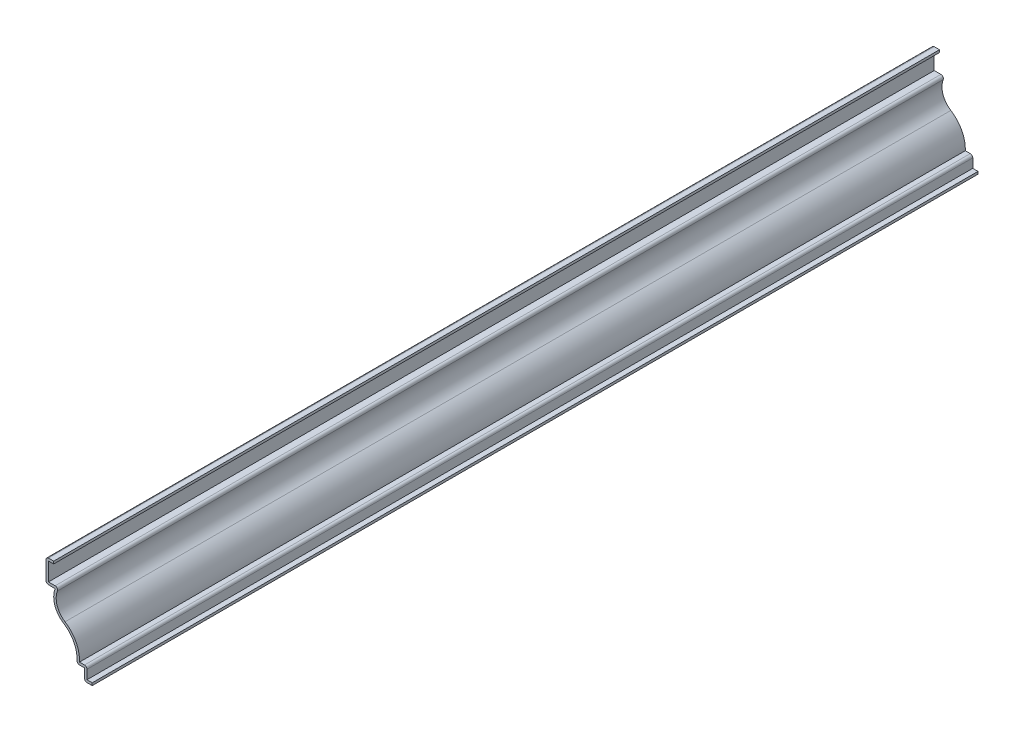
ISO-10303-21;
HEADER;
FILE_DESCRIPTION(('STEP AP214'),'2;1');
FILE_NAME('part.step','',(''),(''),'','','');
FILE_SCHEMA(('AUTOMOTIVE_DESIGN { 1 0 10303 214 1 1 1 1 }'));
ENDSEC;
DATA;
#1=APPLICATION_CONTEXT('core data for automotive mechanical design processes');
#2=APPLICATION_PROTOCOL_DEFINITION('international standard','automotive_design',2000,#1);
#3=PRODUCT_CONTEXT('',#1,'mechanical');
#4=PRODUCT('Part','Part','',(#3));
#5=PRODUCT_RELATED_PRODUCT_CATEGORY('part','',(#4));
#6=PRODUCT_DEFINITION_FORMATION('','',#4);
#7=PRODUCT_DEFINITION_CONTEXT('part definition',#1,'design');
#8=PRODUCT_DEFINITION('design','',#6,#7);
#9=PRODUCT_DEFINITION_SHAPE('','',#8);
#10=(LENGTH_UNIT() NAMED_UNIT(*) SI_UNIT(.MILLI.,.METRE.));
#11=(NAMED_UNIT(*) PLANE_ANGLE_UNIT() SI_UNIT($,.RADIAN.));
#12=(NAMED_UNIT(*) SI_UNIT($,.STERADIAN.) SOLID_ANGLE_UNIT());
#13=UNCERTAINTY_MEASURE_WITH_UNIT(LENGTH_MEASURE(1.E-05),#10,'distance_accuracy_value','');
#14=(GEOMETRIC_REPRESENTATION_CONTEXT(3) GLOBAL_UNCERTAINTY_ASSIGNED_CONTEXT((#13)) GLOBAL_UNIT_ASSIGNED_CONTEXT((#10,
#11,#12)) REPRESENTATION_CONTEXT('',''));
#15=CARTESIAN_POINT('',(0.,0.,0.));
#16=DIRECTION('',(0.,0.,1.));
#17=DIRECTION('',(1.,0.,0.));
#18=AXIS2_PLACEMENT_3D('',#15,#16,#17);
#19=CARTESIAN_POINT('',(-19.05,35.4965,-365.125));
#20=DIRECTION('',(0.,-1.,0.));
#21=DIRECTION('',(1.,0.,0.));
#22=AXIS2_PLACEMENT_3D('',#19,#20,#21);
#23=PLANE('',#22);
#24=DIRECTION('',(1.,0.,0.));
#25=VECTOR('',#24,1.);
#26=CARTESIAN_POINT('',(-19.05,35.4965,0.));
#27=LINE('',#26,#25);
#28=CARTESIAN_POINT('',(-18.034,35.4965,0.));
#29=VERTEX_POINT('',#28);
#30=CARTESIAN_POINT('',(-15.875,35.4965,0.));
#31=VERTEX_POINT('',#30);
#32=EDGE_CURVE('E264',#29,#31,#27,.T.);
#33=ORIENTED_EDGE('',*,*,#32,.F.);
#34=DIRECTION('',(0.,0.,1.));
#35=VECTOR('',#34,1.);
#36=CARTESIAN_POINT('',(-18.034,35.4965,-365.125));
#37=LINE('',#36,#35);
#38=CARTESIAN_POINT('',(-18.034,35.4965,-365.125));
#39=VERTEX_POINT('',#38);
#40=EDGE_CURVE('E221',#39,#29,#37,.T.);
#41=ORIENTED_EDGE('',*,*,#40,.F.);
#42=DIRECTION('',(1.,0.,0.));
#43=VECTOR('',#42,1.);
#44=CARTESIAN_POINT('',(-19.05,35.4965,-365.125));
#45=LINE('',#44,#43);
#46=CARTESIAN_POINT('',(-15.875,35.4965,-365.125));
#47=VERTEX_POINT('',#46);
#48=EDGE_CURVE('E203',#39,#47,#45,.T.);
#49=ORIENTED_EDGE('',*,*,#48,.T.);
#50=DIRECTION('',(0.,0.,1.));
#51=VECTOR('',#50,1.);
#52=CARTESIAN_POINT('',(-15.875,35.4965,-365.125));
#53=LINE('',#52,#51);
#54=EDGE_CURVE('E211',#47,#31,#53,.T.);
#55=ORIENTED_EDGE('',*,*,#54,.T.);
#56=EDGE_LOOP('',(#33,#41,#49,#55));
#57=FACE_BOUND('',#56,.T.);
#58=ADVANCED_FACE('F35',(#57),#23,.T.);
#59=CARTESIAN_POINT('',(-18.034,26.9875,-365.125));
#60=DIRECTION('',(1.,0.,0.));
#61=DIRECTION('',(0.,1.,0.));
#62=AXIS2_PLACEMENT_3D('',#59,#60,#61);
#63=PLANE('',#62);
#64=DIRECTION('',(0.,1.,0.));
#65=VECTOR('',#64,1.);
#66=CARTESIAN_POINT('',(-18.034,26.9875,0.));
#67=LINE('',#66,#65);
#68=CARTESIAN_POINT('',(-18.034,28.0035,0.));
#69=VERTEX_POINT('',#68);
#70=EDGE_CURVE('E222',#69,#29,#67,.T.);
#71=ORIENTED_EDGE('',*,*,#70,.F.);
#72=DIRECTION('',(0.,0.,1.));
#73=VECTOR('',#72,1.);
#74=CARTESIAN_POINT('',(-18.034,28.0035,-365.125));
#75=LINE('',#74,#73);
#76=CARTESIAN_POINT('',(-18.034,28.0035,-365.125));
#77=VERTEX_POINT('',#76);
#78=EDGE_CURVE('E305',#77,#69,#75,.T.);
#79=ORIENTED_EDGE('',*,*,#78,.F.);
#80=DIRECTION('',(0.,1.,0.));
#81=VECTOR('',#80,1.);
#82=CARTESIAN_POINT('',(-18.034,26.9875,-365.125));
#83=LINE('',#82,#81);
#84=EDGE_CURVE('E219',#77,#39,#83,.T.);
#85=ORIENTED_EDGE('',*,*,#84,.T.);
#86=ORIENTED_EDGE('',*,*,#40,.T.);
#87=EDGE_LOOP('',(#71,#79,#85,#86));
#88=FACE_BOUND('',#87,.T.);
#89=ADVANCED_FACE('F468',(#88),#63,.T.);
#90=CARTESIAN_POINT('',(-15.2861287044251,28.0035,-365.125));
#91=DIRECTION('',(0.,1.,0.));
#92=DIRECTION('',(0.,0.,1.));
#93=AXIS2_PLACEMENT_3D('',#90,#91,#92);
#94=PLANE('',#93);
#95=DIRECTION('',(1.,0.,0.));
#96=VECTOR('',#95,1.);
#97=CARTESIAN_POINT('',(-15.2861287044251,28.0035,0.));
#98=LINE('',#97,#96);
#99=CARTESIAN_POINT('',(-15.2861287044251,28.0035,0.));
#100=VERTEX_POINT('',#99);
#101=EDGE_CURVE('E225',#100,#69,#98,.F.);
#102=ORIENTED_EDGE('',*,*,#101,.F.);
#103=DIRECTION('',(0.,0.,1.));
#104=VECTOR('',#103,1.);
#105=CARTESIAN_POINT('',(-15.2861287044251,28.0035,-365.125));
#106=LINE('',#105,#104);
#107=CARTESIAN_POINT('',(-15.2861287044251,28.0035,-365.125));
#108=VERTEX_POINT('',#107);
#109=EDGE_CURVE('E43',#100,#108,#106,.F.);
#110=ORIENTED_EDGE('',*,*,#109,.T.);
#111=DIRECTION('',(1.,0.,0.));
#112=VECTOR('',#111,1.);
#113=CARTESIAN_POINT('',(-15.2861287044251,28.0035,-365.125));
#114=LINE('',#113,#112);
#115=EDGE_CURVE('E261',#108,#77,#114,.F.);
#116=ORIENTED_EDGE('',*,*,#115,.T.);
#117=ORIENTED_EDGE('',*,*,#78,.T.);
#118=EDGE_LOOP('',(#102,#110,#116,#117));
#119=FACE_BOUND('',#118,.T.);
#120=ADVANCED_FACE('F379',(#119),#94,.T.);
#121=CARTESIAN_POINT('',(-7.02128741364235,23.8125,-365.125));
#122=DIRECTION('',(0.,0.,1.));
#123=DIRECTION('',(1.,0.,0.));
#124=AXIS2_PLACEMENT_3D('',#121,#122,#123);
#125=CYLINDRICAL_SURFACE('',#124,7.83771258635766);
#126=CARTESIAN_POINT('',(-7.02128741364235,23.8125,-365.125));
#127=DIRECTION('',(0.,0.,1.));
#128=DIRECTION('',(1.,0.,0.));
#129=AXIS2_PLACEMENT_3D('',#126,#127,#128);
#130=CIRCLE('',#129,7.83771258635766);
#131=CARTESIAN_POINT('',(-11.2021641709878,17.1830197695266,-365.125));
#132=VERTEX_POINT('',#131);
#133=CARTESIAN_POINT('',(-14.3377041119695,26.6231556677737,-365.125));
#134=VERTEX_POINT('',#133);
#135=EDGE_CURVE('E258',#132,#134,#130,.F.);
#136=ORIENTED_EDGE('',*,*,#135,.T.);
#137=DIRECTION('',(0.,0.,1.));
#138=VECTOR('',#137,1.);
#139=CARTESIAN_POINT('',(-14.3377041119695,26.6231556677737,-365.125));
#140=LINE('',#139,#138);
#141=CARTESIAN_POINT('',(-14.3377041119695,26.6231556677737,0.));
#142=VERTEX_POINT('',#141);
#143=EDGE_CURVE('E373',#134,#142,#140,.T.);
#144=ORIENTED_EDGE('',*,*,#143,.T.);
#145=CARTESIAN_POINT('',(-7.02128741364235,23.8125,0.));
#146=DIRECTION('',(0.,0.,1.));
#147=DIRECTION('',(1.,0.,0.));
#148=AXIS2_PLACEMENT_3D('',#145,#146,#147);
#149=CIRCLE('',#148,7.83771258635766);
#150=CARTESIAN_POINT('',(-11.2021641709878,17.1830197695266,0.));
#151=VERTEX_POINT('',#150);
#152=EDGE_CURVE('E299',#151,#142,#149,.F.);
#153=ORIENTED_EDGE('',*,*,#152,.F.);
#154=DIRECTION('',(0.,0.,1.));
#155=VECTOR('',#154,1.);
#156=CARTESIAN_POINT('',(-11.2021641709878,17.1830197695266,-365.125));
#157=LINE('',#156,#155);
#158=EDGE_CURVE('E308',#132,#151,#157,.T.);
#159=ORIENTED_EDGE('',*,*,#158,.F.);
#160=EDGE_LOOP('',(#136,#144,#153,#159));
#161=FACE_BOUND('',#160,.T.);
#162=ADVANCED_FACE('F388',(#161),#125,.F.);
#163=CARTESIAN_POINT('',(-18.034,6.35,-365.125));
#164=DIRECTION('',(0.,0.,1.));
#165=DIRECTION('',(1.,0.,0.));
#166=AXIS2_PLACEMENT_3D('',#163,#164,#165);
#167=CYLINDRICAL_SURFACE('',#166,12.8073532832326);
#168=CARTESIAN_POINT('',(-18.034,6.35,0.));
#169=DIRECTION('',(0.,0.,1.));
#170=DIRECTION('',(1.,0.,0.));
#171=AXIS2_PLACEMENT_3D('',#168,#169,#170);
#172=CIRCLE('',#171,12.8073532832326);
#173=CARTESIAN_POINT('',(-5.23940403640941,5.7785,0.));
#174=VERTEX_POINT('',#173);
#175=EDGE_CURVE('E296',#174,#151,#172,.T.);
#176=ORIENTED_EDGE('',*,*,#175,.F.);
#177=DIRECTION('',(0.,0.,1.));
#178=VECTOR('',#177,1.);
#179=CARTESIAN_POINT('',(-5.23940403640941,5.7785,-365.125));
#180=LINE('',#179,#178);
#181=CARTESIAN_POINT('',(-5.23940403640941,5.7785,-365.125));
#182=VERTEX_POINT('',#181);
#183=EDGE_CURVE('E310',#182,#174,#180,.T.);
#184=ORIENTED_EDGE('',*,*,#183,.F.);
#185=CARTESIAN_POINT('',(-18.034,6.35,-365.125));
#186=DIRECTION('',(0.,0.,1.));
#187=DIRECTION('',(1.,0.,0.));
#188=AXIS2_PLACEMENT_3D('',#185,#186,#187);
#189=CIRCLE('',#188,12.8073532832326);
#190=EDGE_CURVE('E255',#182,#132,#189,.T.);
#191=ORIENTED_EDGE('',*,*,#190,.T.);
#192=ORIENTED_EDGE('',*,*,#158,.T.);
#193=EDGE_LOOP('',(#176,#184,#191,#192));
#194=FACE_BOUND('',#193,.T.);
#195=ADVANCED_FACE('F396',(#194),#167,.T.);
#196=CARTESIAN_POINT('',(-3.175,5.7785,-365.125));
#197=DIRECTION('',(0.,1.,0.));
#198=DIRECTION('',(0.,0.,1.));
#199=AXIS2_PLACEMENT_3D('',#196,#197,#198);
#200=PLANE('',#199);
#201=DIRECTION('',(1.,0.,0.));
#202=VECTOR('',#201,1.);
#203=CARTESIAN_POINT('',(-3.175,5.7785,0.));
#204=LINE('',#203,#202);
#205=CARTESIAN_POINT('',(-3.175,5.7785,0.));
#206=VERTEX_POINT('',#205);
#207=EDGE_CURVE('E294',#206,#174,#204,.F.);
#208=ORIENTED_EDGE('',*,*,#207,.F.);
#209=DIRECTION('',(0.,0.,1.));
#210=VECTOR('',#209,1.);
#211=CARTESIAN_POINT('',(-3.175,5.7785,-365.125));
#212=LINE('',#211,#210);
#213=CARTESIAN_POINT('',(-3.175,5.7785,-365.125));
#214=VERTEX_POINT('',#213);
#215=EDGE_CURVE('E371',#206,#214,#212,.F.);
#216=ORIENTED_EDGE('',*,*,#215,.T.);
#217=DIRECTION('',(1.,0.,0.));
#218=VECTOR('',#217,1.);
#219=CARTESIAN_POINT('',(-3.175,5.7785,-365.125));
#220=LINE('',#219,#218);
#221=EDGE_CURVE('E253',#214,#182,#220,.F.);
#222=ORIENTED_EDGE('',*,*,#221,.T.);
#223=ORIENTED_EDGE('',*,*,#183,.T.);
#224=EDGE_LOOP('',(#208,#216,#222,#223));
#225=FACE_BOUND('',#224,.T.);
#226=ADVANCED_FACE('F484',(#225),#200,.T.);
#227=CARTESIAN_POINT('',(-2.159,0.,-365.125));
#228=DIRECTION('',(1.,0.,0.));
#229=DIRECTION('',(0.,0.,-1.));
#230=AXIS2_PLACEMENT_3D('',#227,#228,#229);
#231=PLANE('',#230);
#232=DIRECTION('',(0.,1.,0.));
#233=VECTOR('',#232,1.);
#234=CARTESIAN_POINT('',(-2.159,0.,-365.125));
#235=LINE('',#234,#233);
#236=CARTESIAN_POINT('',(-2.159,1.016,-365.125));
#237=VERTEX_POINT('',#236);
#238=CARTESIAN_POINT('',(-2.159,4.7625,-365.125));
#239=VERTEX_POINT('',#238);
#240=EDGE_CURVE('E250',#237,#239,#235,.T.);
#241=ORIENTED_EDGE('',*,*,#240,.T.);
#242=DIRECTION('',(0.,0.,1.));
#243=VECTOR('',#242,1.);
#244=CARTESIAN_POINT('',(-2.159,4.7625,-365.125));
#245=LINE('',#244,#243);
#246=CARTESIAN_POINT('',(-2.159,4.7625,0.));
#247=VERTEX_POINT('',#246);
#248=EDGE_CURVE('E368',#239,#247,#245,.T.);
#249=ORIENTED_EDGE('',*,*,#248,.T.);
#250=DIRECTION('',(0.,1.,0.));
#251=VECTOR('',#250,1.);
#252=CARTESIAN_POINT('',(-2.159,0.,0.));
#253=LINE('',#252,#251);
#254=CARTESIAN_POINT('',(-2.159,1.016,0.));
#255=VERTEX_POINT('',#254);
#256=EDGE_CURVE('E291',#255,#247,#253,.T.);
#257=ORIENTED_EDGE('',*,*,#256,.F.);
#258=DIRECTION('',(0.,0.,1.));
#259=VECTOR('',#258,1.);
#260=CARTESIAN_POINT('',(-2.159,1.016,-365.125));
#261=LINE('',#260,#259);
#262=EDGE_CURVE('E313',#237,#255,#261,.T.);
#263=ORIENTED_EDGE('',*,*,#262,.F.);
#264=EDGE_LOOP('',(#241,#249,#257,#263));
#265=FACE_BOUND('',#264,.T.);
#266=ADVANCED_FACE('F408',(#265),#231,.T.);
#267=CARTESIAN_POINT('',(0.,1.016,-365.125));
#268=DIRECTION('',(0.,1.,0.));
#269=DIRECTION('',(-1.,0.,0.));
#270=AXIS2_PLACEMENT_3D('',#267,#268,#269);
#271=PLANE('',#270);
#272=DIRECTION('',(-1.,0.,0.));
#273=VECTOR('',#272,1.);
#274=CARTESIAN_POINT('',(0.,1.016,0.));
#275=LINE('',#274,#273);
#276=CARTESIAN_POINT('',(0.,1.016,0.));
#277=VERTEX_POINT('',#276);
#278=EDGE_CURVE('E288',#277,#255,#275,.T.);
#279=ORIENTED_EDGE('',*,*,#278,.F.);
#280=DIRECTION('',(0.,0.,1.));
#281=VECTOR('',#280,1.);
#282=CARTESIAN_POINT('',(0.,1.016,-365.125));
#283=LINE('',#282,#281);
#284=CARTESIAN_POINT('',(0.,1.016,-365.125));
#285=VERTEX_POINT('',#284);
#286=EDGE_CURVE('E315',#285,#277,#283,.T.);
#287=ORIENTED_EDGE('',*,*,#286,.F.);
#288=DIRECTION('',(-1.,0.,0.));
#289=VECTOR('',#288,1.);
#290=CARTESIAN_POINT('',(0.,1.016,-365.125));
#291=LINE('',#290,#289);
#292=EDGE_CURVE('E247',#285,#237,#291,.T.);
#293=ORIENTED_EDGE('',*,*,#292,.T.);
#294=ORIENTED_EDGE('',*,*,#262,.T.);
#295=EDGE_LOOP('',(#279,#287,#293,#294));
#296=FACE_BOUND('',#295,.T.);
#297=ADVANCED_FACE('F413',(#296),#271,.T.);
#298=CARTESIAN_POINT('',(0.,1.016,-365.125));
#299=DIRECTION('',(-1.,0.,0.));
#300=DIRECTION('',(0.,-1.,0.));
#301=AXIS2_PLACEMENT_3D('',#298,#299,#300);
#302=PLANE('',#301);
#303=DIRECTION('',(0.,-1.,0.));
#304=VECTOR('',#303,1.);
#305=CARTESIAN_POINT('',(0.,1.016,0.));
#306=LINE('',#305,#304);
#307=CARTESIAN_POINT('',(0.,0.,0.));
#308=VERTEX_POINT('',#307);
#309=EDGE_CURVE('E286',#277,#308,#306,.T.);
#310=ORIENTED_EDGE('',*,*,#309,.T.);
#311=DIRECTION('',(0.,0.,1.));
#312=VECTOR('',#311,1.);
#313=CARTESIAN_POINT('',(0.,0.,-365.125));
#314=LINE('',#313,#312);
#315=CARTESIAN_POINT('',(0.,0.,-365.125));
#316=VERTEX_POINT('',#315);
#317=EDGE_CURVE('E317',#316,#308,#314,.T.);
#318=ORIENTED_EDGE('',*,*,#317,.F.);
#319=DIRECTION('',(0.,-1.,0.));
#320=VECTOR('',#319,1.);
#321=CARTESIAN_POINT('',(0.,1.016,-365.125));
#322=LINE('',#321,#320);
#323=EDGE_CURVE('E245',#285,#316,#322,.T.);
#324=ORIENTED_EDGE('',*,*,#323,.F.);
#325=ORIENTED_EDGE('',*,*,#286,.T.);
#326=EDGE_LOOP('',(#310,#318,#324,#325));
#327=FACE_BOUND('',#326,.T.);
#328=ADVANCED_FACE('F420',(#327),#302,.F.);
#329=CARTESIAN_POINT('',(0.,0.,-365.125));
#330=DIRECTION('',(0.,1.,0.));
#331=DIRECTION('',(-1.,0.,0.));
#332=AXIS2_PLACEMENT_3D('',#329,#330,#331);
#333=PLANE('',#332);
#334=DIRECTION('',(-1.,0.,0.));
#335=VECTOR('',#334,1.);
#336=CARTESIAN_POINT('',(0.,0.,0.));
#337=LINE('',#336,#335);
#338=CARTESIAN_POINT('',(-2.159,0.,0.));
#339=VERTEX_POINT('',#338);
#340=EDGE_CURVE('E283',#308,#339,#337,.T.);
#341=ORIENTED_EDGE('',*,*,#340,.T.);
#342=DIRECTION('',(0.,0.,1.));
#343=VECTOR('',#342,1.);
#344=CARTESIAN_POINT('',(-2.159,0.,-365.125));
#345=LINE('',#344,#343);
#346=CARTESIAN_POINT('',(-2.159,0.,-365.125));
#347=VERTEX_POINT('',#346);
#348=EDGE_CURVE('E344',#339,#347,#345,.F.);
#349=ORIENTED_EDGE('',*,*,#348,.T.);
#350=DIRECTION('',(-1.,0.,0.));
#351=VECTOR('',#350,1.);
#352=CARTESIAN_POINT('',(0.,0.,-365.125));
#353=LINE('',#352,#351);
#354=EDGE_CURVE('E243',#316,#347,#353,.T.);
#355=ORIENTED_EDGE('',*,*,#354,.F.);
#356=ORIENTED_EDGE('',*,*,#317,.T.);
#357=EDGE_LOOP('',(#341,#349,#355,#356));
#358=FACE_BOUND('',#357,.T.);
#359=ADVANCED_FACE('F422',(#358),#333,.F.);
#360=CARTESIAN_POINT('',(-3.175,0.,-365.125));
#361=DIRECTION('',(1.,0.,0.));
#362=DIRECTION('',(0.,0.,-1.));
#363=AXIS2_PLACEMENT_3D('',#360,#361,#362);
#364=PLANE('',#363);
#365=DIRECTION('',(0.,1.,0.));
#366=VECTOR('',#365,1.);
#367=CARTESIAN_POINT('',(-3.175,0.,-365.125));
#368=LINE('',#367,#366);
#369=CARTESIAN_POINT('',(-3.175,1.016,-365.125));
#370=VERTEX_POINT('',#369);
#371=CARTESIAN_POINT('',(-3.175,4.7625,-365.125));
#372=VERTEX_POINT('',#371);
#373=EDGE_CURVE('E241',#370,#372,#368,.T.);
#374=ORIENTED_EDGE('',*,*,#373,.F.);
#375=DIRECTION('',(0.,0.,1.));
#376=VECTOR('',#375,1.);
#377=CARTESIAN_POINT('',(-3.175,1.016,-365.125));
#378=LINE('',#377,#376);
#379=CARTESIAN_POINT('',(-3.175,1.016,0.));
#380=VERTEX_POINT('',#379);
#381=EDGE_CURVE('E304',#370,#380,#378,.T.);
#382=ORIENTED_EDGE('',*,*,#381,.T.);
#383=DIRECTION('',(0.,1.,0.));
#384=VECTOR('',#383,1.);
#385=CARTESIAN_POINT('',(-3.175,0.,0.));
#386=LINE('',#385,#384);
#387=CARTESIAN_POINT('',(-3.175,4.7625,0.));
#388=VERTEX_POINT('',#387);
#389=EDGE_CURVE('E281',#380,#388,#386,.T.);
#390=ORIENTED_EDGE('',*,*,#389,.T.);
#391=DIRECTION('',(0.,0.,1.));
#392=VECTOR('',#391,1.);
#393=CARTESIAN_POINT('',(-3.175,4.7625,-365.125));
#394=LINE('',#393,#392);
#395=EDGE_CURVE('E320',#372,#388,#394,.T.);
#396=ORIENTED_EDGE('',*,*,#395,.F.);
#397=EDGE_LOOP('',(#374,#382,#390,#396));
#398=FACE_BOUND('',#397,.T.);
#399=ADVANCED_FACE('F430',(#398),#364,.F.);
#400=CARTESIAN_POINT('',(-3.175,4.7625,-365.125));
#401=DIRECTION('',(0.,1.,0.));
#402=DIRECTION('',(0.,0.,1.));
#403=AXIS2_PLACEMENT_3D('',#400,#401,#402);
#404=PLANE('',#403);
#405=DIRECTION('',(-1.,0.,0.));
#406=VECTOR('',#405,1.);
#407=CARTESIAN_POINT('',(-3.175,4.7625,0.));
#408=LINE('',#407,#406);
#409=CARTESIAN_POINT('',(-5.23940403640941,4.7625,0.));
#410=VERTEX_POINT('',#409);
#411=EDGE_CURVE('E278',#388,#410,#408,.T.);
#412=ORIENTED_EDGE('',*,*,#411,.T.);
#413=DIRECTION('',(0.,0.,1.));
#414=VECTOR('',#413,1.);
#415=CARTESIAN_POINT('',(-5.23940403640941,4.7625,-365.125));
#416=LINE('',#415,#414);
#417=CARTESIAN_POINT('',(-5.23940403640941,4.7625,-365.125));
#418=VERTEX_POINT('',#417);
#419=EDGE_CURVE('E360',#410,#418,#416,.F.);
#420=ORIENTED_EDGE('',*,*,#419,.T.);
#421=DIRECTION('',(-1.,0.,0.));
#422=VECTOR('',#421,1.);
#423=CARTESIAN_POINT('',(-3.175,4.7625,-365.125));
#424=LINE('',#423,#422);
#425=EDGE_CURVE('E238',#372,#418,#424,.T.);
#426=ORIENTED_EDGE('',*,*,#425,.F.);
#427=ORIENTED_EDGE('',*,*,#395,.T.);
#428=EDGE_LOOP('',(#412,#420,#426,#427));
#429=FACE_BOUND('',#428,.T.);
#430=ADVANCED_FACE('F434',(#429),#404,.F.);
#431=CARTESIAN_POINT('',(-18.034,6.35,-365.125));
#432=DIRECTION('',(0.,0.,1.));
#433=DIRECTION('',(1.,0.,0.));
#434=AXIS2_PLACEMENT_3D('',#431,#432,#433);
#435=CYLINDRICAL_SURFACE('',#434,11.7913532832326);
#436=CARTESIAN_POINT('',(-18.034,6.35,-365.125));
#437=DIRECTION('',(0.,0.,1.));
#438=DIRECTION('',(1.,0.,0.));
#439=AXIS2_PLACEMENT_3D('',#436,#437,#438);
#440=CIRCLE('',#439,11.7913532832326);
#441=CARTESIAN_POINT('',(-6.25439200554951,5.82383676764896,-365.125));
#442=VERTEX_POINT('',#441);
#443=CARTESIAN_POINT('',(-11.7441297940774,16.323642516285,-365.125));
#444=VERTEX_POINT('',#443);
#445=EDGE_CURVE('E236',#442,#444,#440,.T.);
#446=ORIENTED_EDGE('',*,*,#445,.F.);
#447=DIRECTION('',(0.,0.,1.));
#448=VECTOR('',#447,1.);
#449=CARTESIAN_POINT('',(-6.25439200554951,5.82383676764896,-365.125));
#450=LINE('',#449,#448);
#451=CARTESIAN_POINT('',(-6.25439200554951,5.82383676764896,0.));
#452=VERTEX_POINT('',#451);
#453=EDGE_CURVE('E357',#442,#452,#450,.T.);
#454=ORIENTED_EDGE('',*,*,#453,.T.);
#455=CARTESIAN_POINT('',(-18.034,6.35,0.));
#456=DIRECTION('',(0.,0.,1.));
#457=DIRECTION('',(1.,0.,0.));
#458=AXIS2_PLACEMENT_3D('',#455,#456,#457);
#459=CIRCLE('',#458,11.7913532832326);
#460=CARTESIAN_POINT('',(-11.7441297940774,16.323642516285,0.));
#461=VERTEX_POINT('',#460);
#462=EDGE_CURVE('E276',#452,#461,#459,.T.);
#463=ORIENTED_EDGE('',*,*,#462,.T.);
#464=DIRECTION('',(0.,0.,1.));
#465=VECTOR('',#464,1.);
#466=CARTESIAN_POINT('',(-11.7441297940774,16.323642516285,-365.125));
#467=LINE('',#466,#465);
#468=EDGE_CURVE('E323',#444,#461,#467,.T.);
#469=ORIENTED_EDGE('',*,*,#468,.F.);
#470=EDGE_LOOP('',(#446,#454,#463,#469));
#471=FACE_BOUND('',#470,.T.);
#472=ADVANCED_FACE('F443',(#471),#435,.F.);
#473=CARTESIAN_POINT('',(-7.02128741364235,23.8125,-365.125));
#474=DIRECTION('',(0.,0.,1.));
#475=DIRECTION('',(1.,0.,0.));
#476=AXIS2_PLACEMENT_3D('',#473,#474,#475);
#477=CYLINDRICAL_SURFACE('',#476,8.85371258635766);
#478=CARTESIAN_POINT('',(-7.02128741364235,23.8125,0.));
#479=DIRECTION('',(0.,0.,-1.));
#480=DIRECTION('',(-1.,0.,0.));
#481=AXIS2_PLACEMENT_3D('',#478,#479,#480);
#482=CIRCLE('',#481,8.85371258635766);
#483=CARTESIAN_POINT('',(-15.2861287044251,26.9875,0.));
#484=VERTEX_POINT('',#483);
#485=EDGE_CURVE('E274',#461,#484,#482,.T.);
#486=ORIENTED_EDGE('',*,*,#485,.T.);
#487=DIRECTION('',(0.,0.,1.));
#488=VECTOR('',#487,1.);
#489=CARTESIAN_POINT('',(-15.2861287044251,26.9875,-365.125));
#490=LINE('',#489,#488);
#491=CARTESIAN_POINT('',(-15.2861287044251,26.9875,-365.125));
#492=VERTEX_POINT('',#491);
#493=EDGE_CURVE('E326',#492,#484,#490,.T.);
#494=ORIENTED_EDGE('',*,*,#493,.F.);
#495=CARTESIAN_POINT('',(-7.02128741364235,23.8125,-365.125));
#496=DIRECTION('',(0.,0.,-1.));
#497=DIRECTION('',(-1.,0.,0.));
#498=AXIS2_PLACEMENT_3D('',#495,#496,#497);
#499=CIRCLE('',#498,8.85371258635766);
#500=EDGE_CURVE('E234',#444,#492,#499,.T.);
#501=ORIENTED_EDGE('',*,*,#500,.F.);
#502=ORIENTED_EDGE('',*,*,#468,.T.);
#503=EDGE_LOOP('',(#486,#494,#501,#502));
#504=FACE_BOUND('',#503,.T.);
#505=ADVANCED_FACE('F449',(#504),#477,.T.);
#506=CARTESIAN_POINT('',(-15.2861287044251,26.9875,-365.125));
#507=DIRECTION('',(0.,1.,0.));
#508=DIRECTION('',(0.,0.,1.));
#509=AXIS2_PLACEMENT_3D('',#506,#507,#508);
#510=PLANE('',#509);
#511=DIRECTION('',(-1.,0.,0.));
#512=VECTOR('',#511,1.);
#513=CARTESIAN_POINT('',(-15.2861287044251,26.9875,0.));
#514=LINE('',#513,#512);
#515=CARTESIAN_POINT('',(-18.034,26.9875,0.));
#516=VERTEX_POINT('',#515);
#517=EDGE_CURVE('E271',#484,#516,#514,.T.);
#518=ORIENTED_EDGE('',*,*,#517,.T.);
#519=DIRECTION('',(0.,0.,1.));
#520=VECTOR('',#519,1.);
#521=CARTESIAN_POINT('',(-18.034,26.9875,-365.125));
#522=LINE('',#521,#520);
#523=CARTESIAN_POINT('',(-18.034,26.9875,-365.125));
#524=VERTEX_POINT('',#523);
#525=EDGE_CURVE('E366',#516,#524,#522,.F.);
#526=ORIENTED_EDGE('',*,*,#525,.T.);
#527=DIRECTION('',(-1.,0.,0.));
#528=VECTOR('',#527,1.);
#529=CARTESIAN_POINT('',(-15.2861287044251,26.9875,-365.125));
#530=LINE('',#529,#528);
#531=EDGE_CURVE('E231',#492,#524,#530,.T.);
#532=ORIENTED_EDGE('',*,*,#531,.F.);
#533=ORIENTED_EDGE('',*,*,#493,.T.);
#534=EDGE_LOOP('',(#518,#526,#532,#533));
#535=FACE_BOUND('',#534,.T.);
#536=ADVANCED_FACE('F453',(#535),#510,.F.);
#537=CARTESIAN_POINT('',(-19.05,26.9875,-365.125));
#538=DIRECTION('',(1.,0.,0.));
#539=DIRECTION('',(0.,1.,0.));
#540=AXIS2_PLACEMENT_3D('',#537,#538,#539);
#541=PLANE('',#540);
#542=DIRECTION('',(0.,1.,0.));
#543=VECTOR('',#542,1.);
#544=CARTESIAN_POINT('',(-19.05,26.9875,-365.125));
#545=LINE('',#544,#543);
#546=CARTESIAN_POINT('',(-19.05,28.0035,-365.125));
#547=VERTEX_POINT('',#546);
#548=CARTESIAN_POINT('',(-19.05,35.4965,-365.125));
#549=VERTEX_POINT('',#548);
#550=EDGE_CURVE('E229',#547,#549,#545,.T.);
#551=ORIENTED_EDGE('',*,*,#550,.F.);
#552=DIRECTION('',(0.,0.,1.));
#553=VECTOR('',#552,1.);
#554=CARTESIAN_POINT('',(-19.05,28.0035,-365.125));
#555=LINE('',#554,#553);
#556=CARTESIAN_POINT('',(-19.05,28.0035,0.));
#557=VERTEX_POINT('',#556);
#558=EDGE_CURVE('E363',#547,#557,#555,.T.);
#559=ORIENTED_EDGE('',*,*,#558,.T.);
#560=DIRECTION('',(0.,1.,0.));
#561=VECTOR('',#560,1.);
#562=CARTESIAN_POINT('',(-19.05,26.9875,0.));
#563=LINE('',#562,#561);
#564=CARTESIAN_POINT('',(-19.05,35.4965,0.));
#565=VERTEX_POINT('',#564);
#566=EDGE_CURVE('E269',#557,#565,#563,.T.);
#567=ORIENTED_EDGE('',*,*,#566,.T.);
#568=DIRECTION('',(0.,0.,1.));
#569=VECTOR('',#568,1.);
#570=CARTESIAN_POINT('',(-19.05,35.4965,-365.125));
#571=LINE('',#570,#569);
#572=EDGE_CURVE('E58',#565,#549,#571,.F.);
#573=ORIENTED_EDGE('',*,*,#572,.T.);
#574=EDGE_LOOP('',(#551,#559,#567,#573));
#575=FACE_BOUND('',#574,.T.);
#576=ADVANCED_FACE('F460',(#575),#541,.F.);
#577=CARTESIAN_POINT('',(-19.05,36.5125,-365.125));
#578=DIRECTION('',(0.,-1.,0.));
#579=DIRECTION('',(1.,0.,0.));
#580=AXIS2_PLACEMENT_3D('',#577,#578,#579);
#581=PLANE('',#580);
#582=DIRECTION('',(1.,0.,0.));
#583=VECTOR('',#582,1.);
#584=CARTESIAN_POINT('',(-19.05,36.5125,-365.125));
#585=LINE('',#584,#583);
#586=CARTESIAN_POINT('',(-18.034,36.5125,-365.125));
#587=VERTEX_POINT('',#586);
#588=CARTESIAN_POINT('',(-15.875,36.5125,-365.125));
#589=VERTEX_POINT('',#588);
#590=EDGE_CURVE('E205',#587,#589,#585,.T.);
#591=ORIENTED_EDGE('',*,*,#590,.F.);
#592=DIRECTION('',(0.,0.,1.));
#593=VECTOR('',#592,1.);
#594=CARTESIAN_POINT('',(-18.034,36.5125,-365.125));
#595=LINE('',#594,#593);
#596=CARTESIAN_POINT('',(-18.034,36.5125,0.));
#597=VERTEX_POINT('',#596);
#598=EDGE_CURVE('E11',#587,#597,#595,.T.);
#599=ORIENTED_EDGE('',*,*,#598,.T.);
#600=DIRECTION('',(1.,0.,0.));
#601=VECTOR('',#600,1.);
#602=CARTESIAN_POINT('',(-19.05,36.5125,0.));
#603=LINE('',#602,#601);
#604=CARTESIAN_POINT('',(-15.875,36.5125,0.));
#605=VERTEX_POINT('',#604);
#606=EDGE_CURVE('E267',#597,#605,#603,.T.);
#607=ORIENTED_EDGE('',*,*,#606,.T.);
#608=DIRECTION('',(0.,0.,1.));
#609=VECTOR('',#608,1.);
#610=CARTESIAN_POINT('',(-15.875,36.5125,-365.125));
#611=LINE('',#610,#609);
#612=EDGE_CURVE('E218',#589,#605,#611,.T.);
#613=ORIENTED_EDGE('',*,*,#612,.F.);
#614=EDGE_LOOP('',(#591,#599,#607,#613));
#615=FACE_BOUND('',#614,.T.);
#616=ADVANCED_FACE('F465',(#615),#581,.F.);
#617=CARTESIAN_POINT('',(-15.875,36.5125,-365.125));
#618=DIRECTION('',(-1.,0.,0.));
#619=DIRECTION('',(0.,-1.,0.));
#620=AXIS2_PLACEMENT_3D('',#617,#618,#619);
#621=PLANE('',#620);
#622=DIRECTION('',(0.,-1.,0.));
#623=VECTOR('',#622,1.);
#624=CARTESIAN_POINT('',(-15.875,36.5125,0.));
#625=LINE('',#624,#623);
#626=EDGE_CURVE('E214',#605,#31,#625,.T.);
#627=ORIENTED_EDGE('',*,*,#626,.T.);
#628=ORIENTED_EDGE('',*,*,#54,.F.);
#629=DIRECTION('',(0.,-1.,0.));
#630=VECTOR('',#629,1.);
#631=CARTESIAN_POINT('',(-15.875,36.5125,-365.125));
#632=LINE('',#631,#630);
#633=EDGE_CURVE('E197',#589,#47,#632,.T.);
#634=ORIENTED_EDGE('',*,*,#633,.F.);
#635=ORIENTED_EDGE('',*,*,#612,.T.);
#636=EDGE_LOOP('',(#627,#628,#634,#635));
#637=FACE_BOUND('',#636,.T.);
#638=ADVANCED_FACE('F212',(#637),#621,.F.);
#639=CARTESIAN_POINT('',(-7.02128741364235,23.8125,-365.125));
#640=DIRECTION('',(0.,0.,-1.));
#641=DIRECTION('',(-1.,0.,0.));
#642=AXIS2_PLACEMENT_3D('',#639,#640,#641);
#643=PLANE('',#642);
#644=ORIENTED_EDGE('',*,*,#354,.T.);
#645=CARTESIAN_POINT('',(-2.159,1.016,-365.125));
#646=DIRECTION('',(0.,0.,-1.));
#647=DIRECTION('',(-1.,0.,0.));
#648=AXIS2_PLACEMENT_3D('',#645,#646,#647);
#649=CIRCLE('',#648,1.016);
#650=EDGE_CURVE('E355',#347,#370,#649,.T.);
#651=ORIENTED_EDGE('',*,*,#650,.T.);
#652=ORIENTED_EDGE('',*,*,#373,.T.);
#653=ORIENTED_EDGE('',*,*,#425,.T.);
#654=CARTESIAN_POINT('',(-5.23940403640941,5.7785,-365.125));
#655=DIRECTION('',(0.,0.,-1.));
#656=DIRECTION('',(-1.,0.,0.));
#657=AXIS2_PLACEMENT_3D('',#654,#655,#656);
#658=CIRCLE('',#657,1.016);
#659=EDGE_CURVE('E353',#418,#442,#658,.T.);
#660=ORIENTED_EDGE('',*,*,#659,.T.);
#661=ORIENTED_EDGE('',*,*,#445,.T.);
#662=ORIENTED_EDGE('',*,*,#500,.T.);
#663=ORIENTED_EDGE('',*,*,#531,.T.);
#664=CARTESIAN_POINT('',(-18.034,28.0035,-365.125));
#665=DIRECTION('',(0.,0.,-1.));
#666=DIRECTION('',(-1.,0.,0.));
#667=AXIS2_PLACEMENT_3D('',#664,#665,#666);
#668=CIRCLE('',#667,1.016);
#669=EDGE_CURVE('E351',#524,#547,#668,.T.);
#670=ORIENTED_EDGE('',*,*,#669,.T.);
#671=ORIENTED_EDGE('',*,*,#550,.T.);
#672=CARTESIAN_POINT('',(-18.034,35.4965,-365.125));
#673=DIRECTION('',(0.,0.,-1.));
#674=DIRECTION('',(-1.,0.,0.));
#675=AXIS2_PLACEMENT_3D('',#672,#673,#674);
#676=CIRCLE('',#675,1.016);
#677=EDGE_CURVE('E50',#549,#587,#676,.T.);
#678=ORIENTED_EDGE('',*,*,#677,.T.);
#679=ORIENTED_EDGE('',*,*,#590,.T.);
#680=ORIENTED_EDGE('',*,*,#633,.T.);
#681=ORIENTED_EDGE('',*,*,#48,.F.);
#682=ORIENTED_EDGE('',*,*,#84,.F.);
#683=ORIENTED_EDGE('',*,*,#115,.F.);
#684=CARTESIAN_POINT('',(-15.2861287044251,26.9875,-365.125));
#685=DIRECTION('',(0.,0.,-1.));
#686=DIRECTION('',(-1.,0.,0.));
#687=AXIS2_PLACEMENT_3D('',#684,#685,#686);
#688=CIRCLE('',#687,1.016);
#689=EDGE_CURVE('E347',#108,#134,#688,.T.);
#690=ORIENTED_EDGE('',*,*,#689,.T.);
#691=ORIENTED_EDGE('',*,*,#135,.F.);
#692=ORIENTED_EDGE('',*,*,#190,.F.);
#693=ORIENTED_EDGE('',*,*,#221,.F.);
#694=CARTESIAN_POINT('',(-3.175,4.7625,-365.125));
#695=DIRECTION('',(0.,0.,-1.));
#696=DIRECTION('',(-1.,0.,0.));
#697=AXIS2_PLACEMENT_3D('',#694,#695,#696);
#698=CIRCLE('',#697,1.016);
#699=EDGE_CURVE('E349',#214,#239,#698,.T.);
#700=ORIENTED_EDGE('',*,*,#699,.T.);
#701=ORIENTED_EDGE('',*,*,#240,.F.);
#702=ORIENTED_EDGE('',*,*,#292,.F.);
#703=ORIENTED_EDGE('',*,*,#323,.T.);
#704=EDGE_LOOP('',(#644,#651,#652,#653,#660,#661,#662,#663,#670,#671,#678,#679,#680,#681,#682,
#683,#690,#691,#692,#693,#700,#701,#702,#703));
#705=FACE_BOUND('',#704,.T.);
#706=ADVANCED_FACE('F200',(#705),#643,.T.);
#707=CARTESIAN_POINT('',(-7.02128741364235,23.8125,0.));
#708=DIRECTION('',(0.,0.,-1.));
#709=DIRECTION('',(-1.,0.,0.));
#710=AXIS2_PLACEMENT_3D('',#707,#708,#709);
#711=PLANE('',#710);
#712=ORIENTED_EDGE('',*,*,#389,.F.);
#713=CARTESIAN_POINT('',(-2.159,1.016,0.));
#714=DIRECTION('',(0.,0.,-1.));
#715=DIRECTION('',(-1.,0.,0.));
#716=AXIS2_PLACEMENT_3D('',#713,#714,#715);
#717=CIRCLE('',#716,1.016);
#718=EDGE_CURVE('E342',#380,#339,#717,.F.);
#719=ORIENTED_EDGE('',*,*,#718,.T.);
#720=ORIENTED_EDGE('',*,*,#340,.F.);
#721=ORIENTED_EDGE('',*,*,#309,.F.);
#722=ORIENTED_EDGE('',*,*,#278,.T.);
#723=ORIENTED_EDGE('',*,*,#256,.T.);
#724=CARTESIAN_POINT('',(-3.175,4.7625,0.));
#725=DIRECTION('',(0.,0.,-1.));
#726=DIRECTION('',(-1.,0.,0.));
#727=AXIS2_PLACEMENT_3D('',#724,#725,#726);
#728=CIRCLE('',#727,1.016);
#729=EDGE_CURVE('E336',#247,#206,#728,.F.);
#730=ORIENTED_EDGE('',*,*,#729,.T.);
#731=ORIENTED_EDGE('',*,*,#207,.T.);
#732=ORIENTED_EDGE('',*,*,#175,.T.);
#733=ORIENTED_EDGE('',*,*,#152,.T.);
#734=CARTESIAN_POINT('',(-15.2861287044251,26.9875,0.));
#735=DIRECTION('',(0.,0.,-1.));
#736=DIRECTION('',(-1.,0.,0.));
#737=AXIS2_PLACEMENT_3D('',#734,#735,#736);
#738=CIRCLE('',#737,1.016);
#739=EDGE_CURVE('E334',#142,#100,#738,.F.);
#740=ORIENTED_EDGE('',*,*,#739,.T.);
#741=ORIENTED_EDGE('',*,*,#101,.T.);
#742=ORIENTED_EDGE('',*,*,#70,.T.);
#743=ORIENTED_EDGE('',*,*,#32,.T.);
#744=ORIENTED_EDGE('',*,*,#626,.F.);
#745=ORIENTED_EDGE('',*,*,#606,.F.);
#746=CARTESIAN_POINT('',(-18.034,35.4965,0.));
#747=DIRECTION('',(0.,0.,-1.));
#748=DIRECTION('',(-1.,0.,0.));
#749=AXIS2_PLACEMENT_3D('',#746,#747,#748);
#750=CIRCLE('',#749,1.016);
#751=EDGE_CURVE('E332',#597,#565,#750,.F.);
#752=ORIENTED_EDGE('',*,*,#751,.T.);
#753=ORIENTED_EDGE('',*,*,#566,.F.);
#754=CARTESIAN_POINT('',(-18.034,28.0035,0.));
#755=DIRECTION('',(0.,0.,-1.));
#756=DIRECTION('',(-1.,0.,0.));
#757=AXIS2_PLACEMENT_3D('',#754,#755,#756);
#758=CIRCLE('',#757,1.016);
#759=EDGE_CURVE('E338',#557,#516,#758,.F.);
#760=ORIENTED_EDGE('',*,*,#759,.T.);
#761=ORIENTED_EDGE('',*,*,#517,.F.);
#762=ORIENTED_EDGE('',*,*,#485,.F.);
#763=ORIENTED_EDGE('',*,*,#462,.F.);
#764=CARTESIAN_POINT('',(-5.23940403640941,5.7785,0.));
#765=DIRECTION('',(0.,0.,-1.));
#766=DIRECTION('',(-1.,0.,0.));
#767=AXIS2_PLACEMENT_3D('',#764,#765,#766);
#768=CIRCLE('',#767,1.016);
#769=EDGE_CURVE('E340',#452,#410,#768,.F.);
#770=ORIENTED_EDGE('',*,*,#769,.T.);
#771=ORIENTED_EDGE('',*,*,#411,.F.);
#772=EDGE_LOOP('',(#712,#719,#720,#721,#722,#723,#730,#731,#732,#733,#740,#741,#742,#743,#744,
#745,#752,#753,#760,#761,#762,#763,#770,#771));
#773=FACE_BOUND('',#772,.T.);
#774=ADVANCED_FACE('F391',(#773),#711,.F.);
#775=CARTESIAN_POINT('',(-2.159,1.016,-365.125));
#776=DIRECTION('',(0.,0.,1.));
#777=DIRECTION('',(1.,0.,0.));
#778=AXIS2_PLACEMENT_3D('',#775,#776,#777);
#779=CYLINDRICAL_SURFACE('',#778,1.016);
#780=ORIENTED_EDGE('',*,*,#650,.F.);
#781=ORIENTED_EDGE('',*,*,#348,.F.);
#782=ORIENTED_EDGE('',*,*,#718,.F.);
#783=ORIENTED_EDGE('',*,*,#381,.F.);
#784=EDGE_LOOP('',(#780,#781,#782,#783));
#785=FACE_BOUND('',#784,.T.);
#786=ADVANCED_FACE('F425',(#785),#779,.T.);
#787=CARTESIAN_POINT('',(-5.23940403640941,5.7785,-365.125));
#788=DIRECTION('',(0.,0.,1.));
#789=DIRECTION('',(1.,0.,0.));
#790=AXIS2_PLACEMENT_3D('',#787,#788,#789);
#791=CYLINDRICAL_SURFACE('',#790,1.016);
#792=ORIENTED_EDGE('',*,*,#659,.F.);
#793=ORIENTED_EDGE('',*,*,#419,.F.);
#794=ORIENTED_EDGE('',*,*,#769,.F.);
#795=ORIENTED_EDGE('',*,*,#453,.F.);
#796=EDGE_LOOP('',(#792,#793,#794,#795));
#797=FACE_BOUND('',#796,.T.);
#798=ADVANCED_FACE('F440',(#797),#791,.T.);
#799=CARTESIAN_POINT('',(-18.034,28.0035,-365.125));
#800=DIRECTION('',(0.,0.,1.));
#801=DIRECTION('',(1.,0.,0.));
#802=AXIS2_PLACEMENT_3D('',#799,#800,#801);
#803=CYLINDRICAL_SURFACE('',#802,1.016);
#804=ORIENTED_EDGE('',*,*,#669,.F.);
#805=ORIENTED_EDGE('',*,*,#525,.F.);
#806=ORIENTED_EDGE('',*,*,#759,.F.);
#807=ORIENTED_EDGE('',*,*,#558,.F.);
#808=EDGE_LOOP('',(#804,#805,#806,#807));
#809=FACE_BOUND('',#808,.T.);
#810=ADVANCED_FACE('F458',(#809),#803,.T.);
#811=CARTESIAN_POINT('',(-3.175,4.7625,-365.125));
#812=DIRECTION('',(0.,0.,1.));
#813=DIRECTION('',(1.,0.,0.));
#814=AXIS2_PLACEMENT_3D('',#811,#812,#813);
#815=CYLINDRICAL_SURFACE('',#814,1.016);
#816=ORIENTED_EDGE('',*,*,#699,.F.);
#817=ORIENTED_EDGE('',*,*,#215,.F.);
#818=ORIENTED_EDGE('',*,*,#729,.F.);
#819=ORIENTED_EDGE('',*,*,#248,.F.);
#820=EDGE_LOOP('',(#816,#817,#818,#819));
#821=FACE_BOUND('',#820,.T.);
#822=ADVANCED_FACE('F405',(#821),#815,.T.);
#823=CARTESIAN_POINT('',(-15.2861287044251,26.9875,-365.125));
#824=DIRECTION('',(0.,0.,1.));
#825=DIRECTION('',(1.,0.,0.));
#826=AXIS2_PLACEMENT_3D('',#823,#824,#825);
#827=CYLINDRICAL_SURFACE('',#826,1.016);
#828=ORIENTED_EDGE('',*,*,#689,.F.);
#829=ORIENTED_EDGE('',*,*,#109,.F.);
#830=ORIENTED_EDGE('',*,*,#739,.F.);
#831=ORIENTED_EDGE('',*,*,#143,.F.);
#832=EDGE_LOOP('',(#828,#829,#830,#831));
#833=FACE_BOUND('',#832,.T.);
#834=ADVANCED_FACE('F385',(#833),#827,.T.);
#835=CARTESIAN_POINT('',(-18.034,35.4965,-365.125));
#836=DIRECTION('',(0.,0.,1.));
#837=DIRECTION('',(1.,0.,0.));
#838=AXIS2_PLACEMENT_3D('',#835,#836,#837);
#839=CYLINDRICAL_SURFACE('',#838,1.016);
#840=ORIENTED_EDGE('',*,*,#677,.F.);
#841=ORIENTED_EDGE('',*,*,#572,.F.);
#842=ORIENTED_EDGE('',*,*,#751,.F.);
#843=ORIENTED_EDGE('',*,*,#598,.F.);
#844=EDGE_LOOP('',(#840,#841,#842,#843));
#845=FACE_BOUND('',#844,.T.);
#846=ADVANCED_FACE('F37',(#845),#839,.T.);
#847=CLOSED_SHELL('',(#58,#89,#120,#162,#195,#226,#266,#297,#328,#359,#399,#430,#472,#505,#536,
#576,#616,#638,#706,#774,#786,#798,#810,#822,#834,#846));
#848=MANIFOLD_SOLID_BREP('B2',#847);
#849=ADVANCED_BREP_SHAPE_REPRESENTATION('',(#18,#848),#14);
#850=SHAPE_DEFINITION_REPRESENTATION(#9,#849);
ENDSEC;
END-ISO-10303-21;
